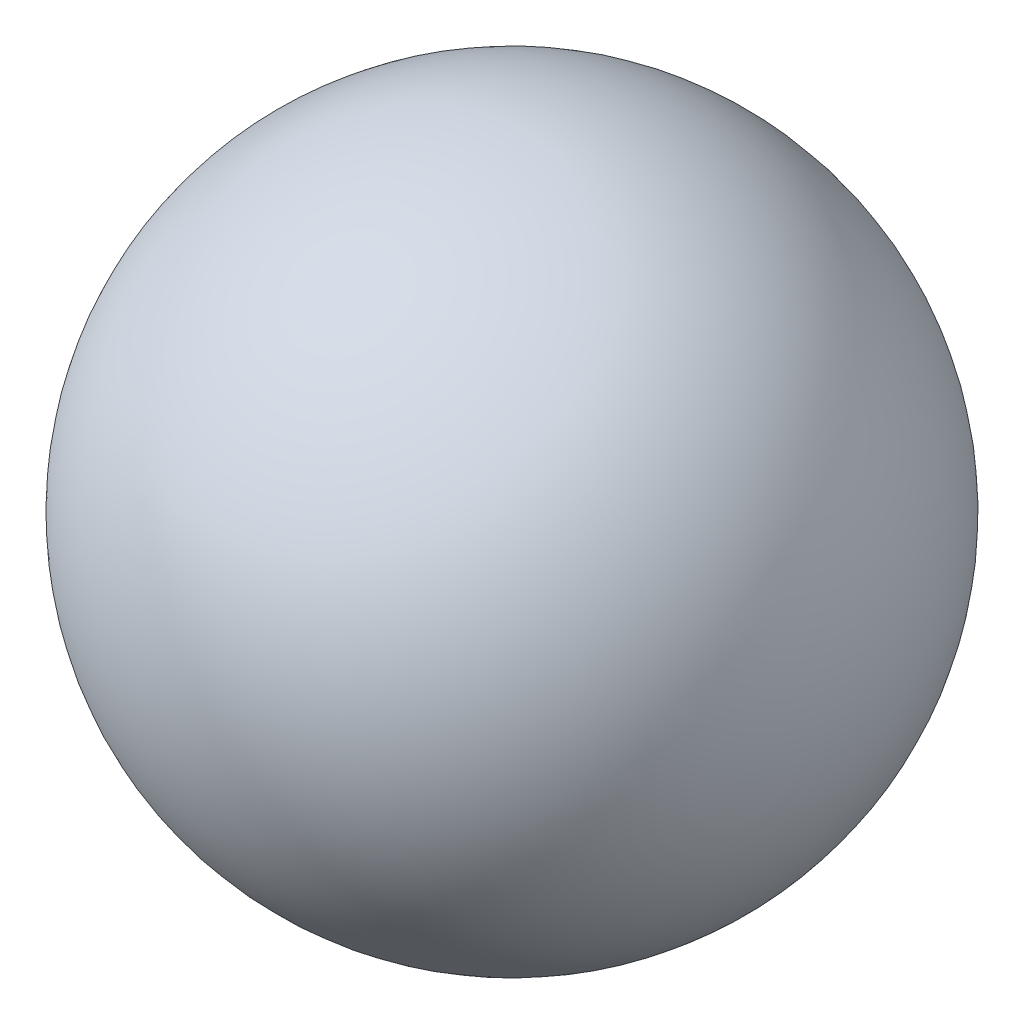
ISO-10303-21;
HEADER;
FILE_DESCRIPTION(('STEP AP214'),'2;1');
FILE_NAME('part.step','',(''),(''),'','','');
FILE_SCHEMA(('AUTOMOTIVE_DESIGN { 1 0 10303 214 1 1 1 1 }'));
ENDSEC;
DATA;
#1=APPLICATION_CONTEXT('core data for automotive mechanical design processes');
#2=APPLICATION_PROTOCOL_DEFINITION('international standard','automotive_design',2000,#1);
#3=PRODUCT_CONTEXT('',#1,'mechanical');
#4=PRODUCT('Part','Part','',(#3));
#5=PRODUCT_RELATED_PRODUCT_CATEGORY('part','',(#4));
#6=PRODUCT_DEFINITION_FORMATION('','',#4);
#7=PRODUCT_DEFINITION_CONTEXT('part definition',#1,'design');
#8=PRODUCT_DEFINITION('design','',#6,#7);
#9=PRODUCT_DEFINITION_SHAPE('','',#8);
#10=(LENGTH_UNIT() NAMED_UNIT(*) SI_UNIT(.MILLI.,.METRE.));
#11=(NAMED_UNIT(*) PLANE_ANGLE_UNIT() SI_UNIT($,.RADIAN.));
#12=(NAMED_UNIT(*) SI_UNIT($,.STERADIAN.) SOLID_ANGLE_UNIT());
#13=UNCERTAINTY_MEASURE_WITH_UNIT(LENGTH_MEASURE(1.E-05),#10,'distance_accuracy_value','');
#14=(GEOMETRIC_REPRESENTATION_CONTEXT(3) GLOBAL_UNCERTAINTY_ASSIGNED_CONTEXT((#13)) GLOBAL_UNIT_ASSIGNED_CONTEXT((#10,
#11,#12)) REPRESENTATION_CONTEXT('',''));
#15=CARTESIAN_POINT('',(0.,0.,0.));
#16=DIRECTION('',(0.,0.,1.));
#17=DIRECTION('',(1.,0.,0.));
#18=AXIS2_PLACEMENT_3D('',#15,#16,#17);
#19=CARTESIAN_POINT('',(64.16,-61.3232373551758,-32.4570677862429));
#20=DIRECTION('',(0.,-0.88383663657057,-0.467795681741101));
#21=DIRECTION('',(0.173648177666933,0.460688814204268,-0.870409172090931));
#22=AXIS2_PLACEMENT_3D('',#19,#20,#21);
#23=SPHERICAL_SURFACE('',#22,7.15);
#24=CARTESIAN_POINT('',(64.16,-55.0038054036962,-29.112328661794));
#25=VERTEX_POINT('',#24);
#26=VERTEX_LOOP('',#25);
#27=FACE_BOUND('',#26,.T.);
#28=CARTESIAN_POINT('',(64.16,-67.6426693066554,-35.8018069106918));
#29=VERTEX_POINT('',#28);
#30=VERTEX_LOOP('',#29);
#31=FACE_BOUND('',#30,.T.);
#32=ADVANCED_FACE('F16',(#27,#31),#23,.T.);
#33=CLOSED_SHELL('',(#32));
#34=MANIFOLD_SOLID_BREP('B1',#33);
#35=ADVANCED_BREP_SHAPE_REPRESENTATION('',(#18,#34),#14);
#36=SHAPE_DEFINITION_REPRESENTATION(#9,#35);
ENDSEC;
END-ISO-10303-21;
